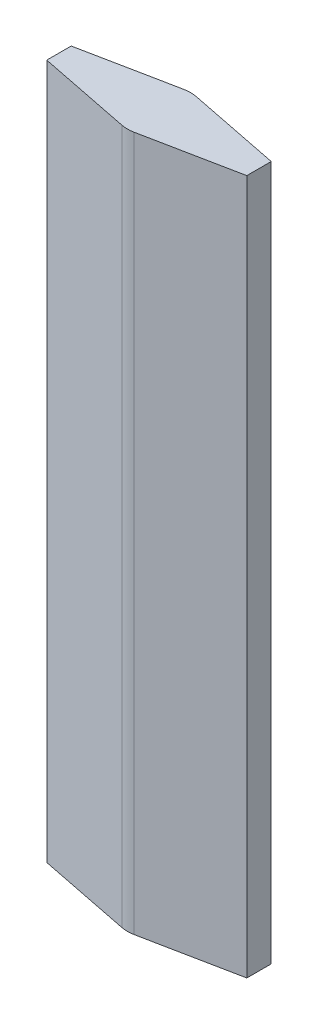
ISO-10303-21;
HEADER;
FILE_DESCRIPTION(('STEP AP214'),'2;1');
FILE_NAME('part.step','',(''),(''),'','','');
FILE_SCHEMA(('AUTOMOTIVE_DESIGN { 1 0 10303 214 1 1 1 1 }'));
ENDSEC;
DATA;
#1=APPLICATION_CONTEXT('core data for automotive mechanical design processes');
#2=APPLICATION_PROTOCOL_DEFINITION('international standard','automotive_design',2000,#1);
#3=PRODUCT_CONTEXT('',#1,'mechanical');
#4=PRODUCT('Part','Part','',(#3));
#5=PRODUCT_RELATED_PRODUCT_CATEGORY('part','',(#4));
#6=PRODUCT_DEFINITION_FORMATION('','',#4);
#7=PRODUCT_DEFINITION_CONTEXT('part definition',#1,'design');
#8=PRODUCT_DEFINITION('design','',#6,#7);
#9=PRODUCT_DEFINITION_SHAPE('','',#8);
#10=(LENGTH_UNIT() NAMED_UNIT(*) SI_UNIT(.MILLI.,.METRE.));
#11=(NAMED_UNIT(*) PLANE_ANGLE_UNIT() SI_UNIT($,.RADIAN.));
#12=(NAMED_UNIT(*) SI_UNIT($,.STERADIAN.) SOLID_ANGLE_UNIT());
#13=UNCERTAINTY_MEASURE_WITH_UNIT(LENGTH_MEASURE(1.E-05),#10,'distance_accuracy_value','');
#14=(GEOMETRIC_REPRESENTATION_CONTEXT(3) GLOBAL_UNCERTAINTY_ASSIGNED_CONTEXT((#13)) GLOBAL_UNIT_ASSIGNED_CONTEXT((#10,
#11,#12)) REPRESENTATION_CONTEXT('',''));
#15=CARTESIAN_POINT('',(0.,0.,0.));
#16=DIRECTION('',(0.,0.,1.));
#17=DIRECTION('',(1.,0.,0.));
#18=AXIS2_PLACEMENT_3D('',#15,#16,#17);
#19=CARTESIAN_POINT('',(190.,660.,-23.2101872151484));
#20=DIRECTION('',(-0.196,0.,0.9806038955664));
#21=DIRECTION('',(0.980603895566401,0.,0.196));
#22=AXIS2_PLACEMENT_3D('',#19,#20,#21);
#23=PLANE('',#22);
#24=DIRECTION('',(-0.9806038955664,0.,-0.196));
#25=VECTOR('',#24,1.);
#26=CARTESIAN_POINT('',(190.,-660.,-23.2101872151484));
#27=LINE('',#26,#25);
#28=CARTESIAN_POINT('',(190.,-660.,-23.2101872151484));
#29=VERTEX_POINT('',#28);
#30=CARTESIAN_POINT('',(11.76,-660.,-58.836233733984));
#31=VERTEX_POINT('',#30);
#32=EDGE_CURVE('E144',#29,#31,#27,.T.);
#33=ORIENTED_EDGE('',*,*,#32,.T.);
#34=DIRECTION('',(0.,-1.,0.));
#35=VECTOR('',#34,1.);
#36=CARTESIAN_POINT('',(11.76,660.,-58.836233733984));
#37=LINE('',#36,#35);
#38=CARTESIAN_POINT('',(11.76,660.,-58.836233733984));
#39=VERTEX_POINT('',#38);
#40=EDGE_CURVE('E48',#39,#31,#37,.T.);
#41=ORIENTED_EDGE('',*,*,#40,.F.);
#42=DIRECTION('',(-0.9806038955664,0.,-0.196));
#43=VECTOR('',#42,1.);
#44=CARTESIAN_POINT('',(190.,660.,-23.2101872151484));
#45=LINE('',#44,#43);
#46=CARTESIAN_POINT('',(190.,660.,-23.2101872151484));
#47=VERTEX_POINT('',#46);
#48=EDGE_CURVE('E100',#47,#39,#45,.T.);
#49=ORIENTED_EDGE('',*,*,#48,.F.);
#50=DIRECTION('',(0.,-1.,0.));
#51=VECTOR('',#50,1.);
#52=CARTESIAN_POINT('',(190.,660.,-23.2101872151484));
#53=LINE('',#52,#51);
#54=EDGE_CURVE('E11',#47,#29,#53,.T.);
#55=ORIENTED_EDGE('',*,*,#54,.T.);
#56=EDGE_LOOP('',(#33,#41,#49,#55));
#57=FACE_BOUND('',#56,.T.);
#58=ADVANCED_FACE('F39',(#57),#23,.F.);
#59=CARTESIAN_POINT('',(0.,660.,0.));
#60=DIRECTION('',(0.,-1.,0.));
#61=DIRECTION('',(0.,0.,-1.));
#62=AXIS2_PLACEMENT_3D('',#59,#60,#61);
#63=CYLINDRICAL_SURFACE('',#62,60.);
#64=CARTESIAN_POINT('',(0.,-660.,0.));
#65=DIRECTION('',(0.,1.,0.));
#66=DIRECTION('',(0.,0.,1.));
#67=AXIS2_PLACEMENT_3D('',#64,#65,#66);
#68=CIRCLE('',#67,60.);
#69=CARTESIAN_POINT('',(-11.7599999672993,-660.,-58.8362337405201));
#70=VERTEX_POINT('',#69);
#71=EDGE_CURVE('E147',#31,#70,#68,.T.);
#72=ORIENTED_EDGE('',*,*,#71,.T.);
#73=DIRECTION('',(0.,-1.,0.));
#74=VECTOR('',#73,1.);
#75=CARTESIAN_POINT('',(-11.7599999672993,660.,-58.8362337405201));
#76=LINE('',#75,#74);
#77=CARTESIAN_POINT('',(-11.7599999672993,660.,-58.8362337405201));
#78=VERTEX_POINT('',#77);
#79=EDGE_CURVE('E176',#78,#70,#76,.T.);
#80=ORIENTED_EDGE('',*,*,#79,.F.);
#81=CARTESIAN_POINT('',(0.,660.,0.));
#82=DIRECTION('',(0.,1.,0.));
#83=DIRECTION('',(0.,0.,1.));
#84=AXIS2_PLACEMENT_3D('',#81,#82,#83);
#85=CIRCLE('',#84,60.);
#86=EDGE_CURVE('E186',#39,#78,#85,.T.);
#87=ORIENTED_EDGE('',*,*,#86,.F.);
#88=ORIENTED_EDGE('',*,*,#40,.T.);
#89=EDGE_LOOP('',(#72,#80,#87,#88));
#90=FACE_BOUND('',#89,.T.);
#91=ADVANCED_FACE('F184',(#90),#63,.T.);
#92=CARTESIAN_POINT('',(-11.7599999672993,660.,-58.8362337405201));
#93=DIRECTION('',(0.196,0.,0.9806038955664));
#94=DIRECTION('',(0.9806038955664,0.,-0.196));
#95=AXIS2_PLACEMENT_3D('',#92,#93,#94);
#96=PLANE('',#95);
#97=DIRECTION('',(-0.9806038955664,0.,0.196));
#98=VECTOR('',#97,1.);
#99=CARTESIAN_POINT('',(-11.7599999672993,-660.,-58.8362337405201));
#100=LINE('',#99,#98);
#101=CARTESIAN_POINT('',(-190.,-660.,-23.2101872151484));
#102=VERTEX_POINT('',#101);
#103=EDGE_CURVE('E150',#70,#102,#100,.T.);
#104=ORIENTED_EDGE('',*,*,#103,.T.);
#105=DIRECTION('',(0.,-1.,0.));
#106=VECTOR('',#105,1.);
#107=CARTESIAN_POINT('',(-190.,660.,-23.2101872151484));
#108=LINE('',#107,#106);
#109=CARTESIAN_POINT('',(-190.,660.,-23.2101872151484));
#110=VERTEX_POINT('',#109);
#111=EDGE_CURVE('E172',#110,#102,#108,.T.);
#112=ORIENTED_EDGE('',*,*,#111,.F.);
#113=DIRECTION('',(-0.9806038955664,0.,0.196));
#114=VECTOR('',#113,1.);
#115=CARTESIAN_POINT('',(-11.7599999672993,660.,-58.8362337405201));
#116=LINE('',#115,#114);
#117=EDGE_CURVE('E199',#78,#110,#116,.T.);
#118=ORIENTED_EDGE('',*,*,#117,.F.);
#119=ORIENTED_EDGE('',*,*,#79,.T.);
#120=EDGE_LOOP('',(#104,#112,#118,#119));
#121=FACE_BOUND('',#120,.T.);
#122=ADVANCED_FACE('F194',(#121),#96,.F.);
#123=CARTESIAN_POINT('',(-190.,660.,0.));
#124=DIRECTION('',(1.,0.,0.));
#125=DIRECTION('',(0.,0.,-1.));
#126=AXIS2_PLACEMENT_3D('',#123,#124,#125);
#127=PLANE('',#126);
#128=DIRECTION('',(0.,0.,1.));
#129=VECTOR('',#128,1.);
#130=CARTESIAN_POINT('',(-190.,-660.,0.));
#131=LINE('',#130,#129);
#132=CARTESIAN_POINT('',(-190.,-660.,23.2101872151484));
#133=VERTEX_POINT('',#132);
#134=EDGE_CURVE('E154',#102,#133,#131,.T.);
#135=ORIENTED_EDGE('',*,*,#134,.T.);
#136=DIRECTION('',(0.,-1.,0.));
#137=VECTOR('',#136,1.);
#138=CARTESIAN_POINT('',(-190.,660.,23.2101872151484));
#139=LINE('',#138,#137);
#140=CARTESIAN_POINT('',(-190.,660.,23.2101872151484));
#141=VERTEX_POINT('',#140);
#142=EDGE_CURVE('E131',#141,#133,#139,.T.);
#143=ORIENTED_EDGE('',*,*,#142,.F.);
#144=DIRECTION('',(0.,0.,1.));
#145=VECTOR('',#144,1.);
#146=CARTESIAN_POINT('',(-190.,660.,0.));
#147=LINE('',#146,#145);
#148=EDGE_CURVE('E120',#110,#141,#147,.T.);
#149=ORIENTED_EDGE('',*,*,#148,.F.);
#150=ORIENTED_EDGE('',*,*,#111,.T.);
#151=EDGE_LOOP('',(#135,#143,#149,#150));
#152=FACE_BOUND('',#151,.T.);
#153=ADVANCED_FACE('F197',(#152),#127,.F.);
#154=CARTESIAN_POINT('',(-190.,660.,23.2101872151484));
#155=DIRECTION('',(0.196,0.,-0.980603895566401));
#156=DIRECTION('',(-0.980603895566401,0.,-0.196));
#157=AXIS2_PLACEMENT_3D('',#154,#155,#156);
#158=PLANE('',#157);
#159=DIRECTION('',(0.980603895566401,0.,0.196));
#160=VECTOR('',#159,1.);
#161=CARTESIAN_POINT('',(-190.,-660.,23.2101872151484));
#162=LINE('',#161,#160);
#163=CARTESIAN_POINT('',(-11.7599999999999,-660.,58.836233733984));
#164=VERTEX_POINT('',#163);
#165=EDGE_CURVE('E129',#133,#164,#162,.T.);
#166=ORIENTED_EDGE('',*,*,#165,.T.);
#167=DIRECTION('',(0.,-1.,0.));
#168=VECTOR('',#167,1.);
#169=CARTESIAN_POINT('',(-11.7599999999999,660.,58.836233733984));
#170=LINE('',#169,#168);
#171=CARTESIAN_POINT('',(-11.7599999999999,660.,58.836233733984));
#172=VERTEX_POINT('',#171);
#173=EDGE_CURVE('E126',#172,#164,#170,.T.);
#174=ORIENTED_EDGE('',*,*,#173,.F.);
#175=DIRECTION('',(0.980603895566401,0.,0.196));
#176=VECTOR('',#175,1.);
#177=CARTESIAN_POINT('',(-190.,660.,23.2101872151484));
#178=LINE('',#177,#176);
#179=EDGE_CURVE('E114',#141,#172,#178,.T.);
#180=ORIENTED_EDGE('',*,*,#179,.F.);
#181=ORIENTED_EDGE('',*,*,#142,.T.);
#182=EDGE_LOOP('',(#166,#174,#180,#181));
#183=FACE_BOUND('',#182,.T.);
#184=ADVANCED_FACE('F127',(#183),#158,.F.);
#185=CARTESIAN_POINT('',(0.,660.,0.));
#186=DIRECTION('',(0.,-1.,0.));
#187=DIRECTION('',(0.,0.,-1.));
#188=AXIS2_PLACEMENT_3D('',#185,#186,#187);
#189=CYLINDRICAL_SURFACE('',#188,60.);
#190=CARTESIAN_POINT('',(0.,-660.,0.));
#191=DIRECTION('',(0.,1.,0.));
#192=DIRECTION('',(0.,0.,1.));
#193=AXIS2_PLACEMENT_3D('',#190,#191,#192);
#194=CIRCLE('',#193,60.);
#195=CARTESIAN_POINT('',(11.76,-660.,58.836233733984));
#196=VERTEX_POINT('',#195);
#197=EDGE_CURVE('E86',#164,#196,#194,.T.);
#198=ORIENTED_EDGE('',*,*,#197,.T.);
#199=DIRECTION('',(0.,-1.,0.));
#200=VECTOR('',#199,1.);
#201=CARTESIAN_POINT('',(11.76,660.,58.836233733984));
#202=LINE('',#201,#200);
#203=CARTESIAN_POINT('',(11.76,660.,58.836233733984));
#204=VERTEX_POINT('',#203);
#205=EDGE_CURVE('E132',#204,#196,#202,.T.);
#206=ORIENTED_EDGE('',*,*,#205,.F.);
#207=CARTESIAN_POINT('',(0.,660.,0.));
#208=DIRECTION('',(0.,1.,0.));
#209=DIRECTION('',(0.,0.,1.));
#210=AXIS2_PLACEMENT_3D('',#207,#208,#209);
#211=CIRCLE('',#210,60.);
#212=EDGE_CURVE('E118',#172,#204,#211,.T.);
#213=ORIENTED_EDGE('',*,*,#212,.F.);
#214=ORIENTED_EDGE('',*,*,#173,.T.);
#215=EDGE_LOOP('',(#198,#206,#213,#214));
#216=FACE_BOUND('',#215,.T.);
#217=ADVANCED_FACE('F134',(#216),#189,.T.);
#218=CARTESIAN_POINT('',(11.76,660.,58.836233733984));
#219=DIRECTION('',(-0.196,0.,-0.9806038955664));
#220=DIRECTION('',(-0.980603895566401,0.,0.196));
#221=AXIS2_PLACEMENT_3D('',#218,#219,#220);
#222=PLANE('',#221);
#223=DIRECTION('',(0.9806038955664,0.,-0.196));
#224=VECTOR('',#223,1.);
#225=CARTESIAN_POINT('',(11.76,-660.,58.836233733984));
#226=LINE('',#225,#224);
#227=CARTESIAN_POINT('',(190.,-660.,23.2101872151484));
#228=VERTEX_POINT('',#227);
#229=EDGE_CURVE('E93',#196,#228,#226,.T.);
#230=ORIENTED_EDGE('',*,*,#229,.T.);
#231=DIRECTION('',(0.,-1.,0.));
#232=VECTOR('',#231,1.);
#233=CARTESIAN_POINT('',(190.,660.,23.2101872151484));
#234=LINE('',#233,#232);
#235=CARTESIAN_POINT('',(190.,660.,23.2101872151484));
#236=VERTEX_POINT('',#235);
#237=EDGE_CURVE('E140',#236,#228,#234,.T.);
#238=ORIENTED_EDGE('',*,*,#237,.F.);
#239=DIRECTION('',(0.9806038955664,0.,-0.196));
#240=VECTOR('',#239,1.);
#241=CARTESIAN_POINT('',(11.76,660.,58.836233733984));
#242=LINE('',#241,#240);
#243=EDGE_CURVE('E137',#204,#236,#242,.T.);
#244=ORIENTED_EDGE('',*,*,#243,.F.);
#245=ORIENTED_EDGE('',*,*,#205,.T.);
#246=EDGE_LOOP('',(#230,#238,#244,#245));
#247=FACE_BOUND('',#246,.T.);
#248=ADVANCED_FACE('F224',(#247),#222,.F.);
#249=CARTESIAN_POINT('',(190.,660.,0.));
#250=DIRECTION('',(-1.,0.,0.));
#251=DIRECTION('',(0.,0.,1.));
#252=AXIS2_PLACEMENT_3D('',#249,#250,#251);
#253=PLANE('',#252);
#254=DIRECTION('',(0.,0.,-1.));
#255=VECTOR('',#254,1.);
#256=CARTESIAN_POINT('',(190.,-660.,0.));
#257=LINE('',#256,#255);
#258=EDGE_CURVE('E163',#228,#29,#257,.T.);
#259=ORIENTED_EDGE('',*,*,#258,.T.);
#260=ORIENTED_EDGE('',*,*,#54,.F.);
#261=DIRECTION('',(0.,0.,-1.));
#262=VECTOR('',#261,1.);
#263=CARTESIAN_POINT('',(190.,660.,0.));
#264=LINE('',#263,#262);
#265=EDGE_CURVE('E56',#236,#47,#264,.T.);
#266=ORIENTED_EDGE('',*,*,#265,.F.);
#267=ORIENTED_EDGE('',*,*,#237,.T.);
#268=EDGE_LOOP('',(#259,#260,#266,#267));
#269=FACE_BOUND('',#268,.T.);
#270=ADVANCED_FACE('F208',(#269),#253,.F.);
#271=CARTESIAN_POINT('',(0.,660.,0.));
#272=DIRECTION('',(0.,1.,0.));
#273=DIRECTION('',(0.,0.,1.));
#274=AXIS2_PLACEMENT_3D('',#271,#272,#273);
#275=PLANE('',#274);
#276=ORIENTED_EDGE('',*,*,#265,.T.);
#277=ORIENTED_EDGE('',*,*,#48,.T.);
#278=ORIENTED_EDGE('',*,*,#86,.T.);
#279=ORIENTED_EDGE('',*,*,#117,.T.);
#280=ORIENTED_EDGE('',*,*,#148,.T.);
#281=ORIENTED_EDGE('',*,*,#179,.T.);
#282=ORIENTED_EDGE('',*,*,#212,.T.);
#283=ORIENTED_EDGE('',*,*,#243,.T.);
#284=EDGE_LOOP('',(#276,#277,#278,#279,#280,#281,#282,#283));
#285=FACE_BOUND('',#284,.T.);
#286=ADVANCED_FACE('F116',(#285),#275,.T.);
#287=CARTESIAN_POINT('',(0.,-660.,0.));
#288=DIRECTION('',(0.,1.,0.));
#289=DIRECTION('',(0.,0.,1.));
#290=AXIS2_PLACEMENT_3D('',#287,#288,#289);
#291=PLANE('',#290);
#292=ORIENTED_EDGE('',*,*,#32,.F.);
#293=ORIENTED_EDGE('',*,*,#258,.F.);
#294=ORIENTED_EDGE('',*,*,#229,.F.);
#295=ORIENTED_EDGE('',*,*,#197,.F.);
#296=ORIENTED_EDGE('',*,*,#165,.F.);
#297=ORIENTED_EDGE('',*,*,#134,.F.);
#298=ORIENTED_EDGE('',*,*,#103,.F.);
#299=ORIENTED_EDGE('',*,*,#71,.F.);
#300=EDGE_LOOP('',(#292,#293,#294,#295,#296,#297,#298,#299));
#301=FACE_BOUND('',#300,.T.);
#302=ADVANCED_FACE('F190',(#301),#291,.F.);
#303=CLOSED_SHELL('',(#58,#91,#122,#153,#184,#217,#248,#270,#286,#302));
#304=MANIFOLD_SOLID_BREP('B2',#303);
#305=ADVANCED_BREP_SHAPE_REPRESENTATION('',(#18,#304),#14);
#306=SHAPE_DEFINITION_REPRESENTATION(#9,#305);
ENDSEC;
END-ISO-10303-21;
